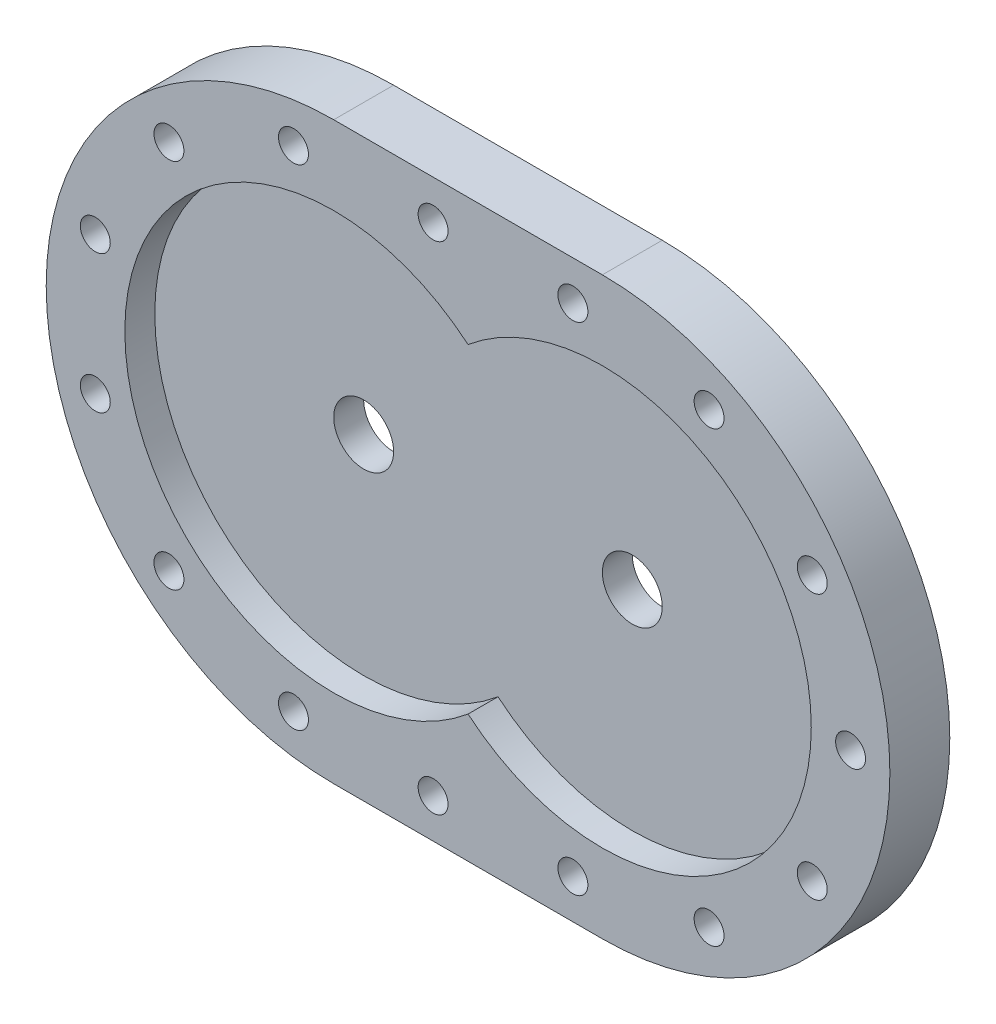
ISO-10303-21;
HEADER;
FILE_DESCRIPTION(('STEP AP214'),'2;1');
FILE_NAME('part.step','',(''),(''),'','','');
FILE_SCHEMA(('AUTOMOTIVE_DESIGN { 1 0 10303 214 1 1 1 1 }'));
ENDSEC;
DATA;
#1=APPLICATION_CONTEXT('core data for automotive mechanical design processes');
#2=APPLICATION_PROTOCOL_DEFINITION('international standard','automotive_design',2000,#1);
#3=PRODUCT_CONTEXT('',#1,'mechanical');
#4=PRODUCT('Part','Part','',(#3));
#5=PRODUCT_RELATED_PRODUCT_CATEGORY('part','',(#4));
#6=PRODUCT_DEFINITION_FORMATION('','',#4);
#7=PRODUCT_DEFINITION_CONTEXT('part definition',#1,'design');
#8=PRODUCT_DEFINITION('design','',#6,#7);
#9=PRODUCT_DEFINITION_SHAPE('','',#8);
#10=(LENGTH_UNIT() NAMED_UNIT(*) SI_UNIT(.MILLI.,.METRE.));
#11=(NAMED_UNIT(*) PLANE_ANGLE_UNIT() SI_UNIT($,.RADIAN.));
#12=(NAMED_UNIT(*) SI_UNIT($,.STERADIAN.) SOLID_ANGLE_UNIT());
#13=UNCERTAINTY_MEASURE_WITH_UNIT(LENGTH_MEASURE(1.E-05),#10,'distance_accuracy_value','');
#14=(GEOMETRIC_REPRESENTATION_CONTEXT(3) GLOBAL_UNCERTAINTY_ASSIGNED_CONTEXT((#13)) GLOBAL_UNIT_ASSIGNED_CONTEXT((#10,
#11,#12)) REPRESENTATION_CONTEXT('',''));
#15=CARTESIAN_POINT('',(0.,0.,0.));
#16=DIRECTION('',(0.,0.,1.));
#17=DIRECTION('',(1.,0.,0.));
#18=AXIS2_PLACEMENT_3D('',#15,#16,#17);
#19=CARTESIAN_POINT('',(0.,-96.,20.));
#20=DIRECTION('',(0.,1.,0.));
#21=DIRECTION('',(-1.,0.,0.));
#22=AXIS2_PLACEMENT_3D('',#19,#20,#21);
#23=PLANE('',#22);
#24=DIRECTION('',(1.,0.,0.));
#25=VECTOR('',#24,1.);
#26=CARTESIAN_POINT('',(0.,-96.,0.));
#27=LINE('',#26,#25);
#28=CARTESIAN_POINT('',(-44.845,-96.,0.));
#29=VERTEX_POINT('',#28);
#30=CARTESIAN_POINT('',(44.845,-96.,0.));
#31=VERTEX_POINT('',#30);
#32=EDGE_CURVE('E157',#29,#31,#27,.T.);
#33=ORIENTED_EDGE('',*,*,#32,.T.);
#34=DIRECTION('',(0.,0.,-1.));
#35=VECTOR('',#34,1.);
#36=CARTESIAN_POINT('',(44.845,-96.,20.));
#37=LINE('',#36,#35);
#38=CARTESIAN_POINT('',(44.845,-96.,20.));
#39=VERTEX_POINT('',#38);
#40=EDGE_CURVE('E13',#39,#31,#37,.T.);
#41=ORIENTED_EDGE('',*,*,#40,.F.);
#42=DIRECTION('',(1.,0.,0.));
#43=VECTOR('',#42,1.);
#44=CARTESIAN_POINT('',(0.,-96.,20.));
#45=LINE('',#44,#43);
#46=CARTESIAN_POINT('',(-44.845,-96.,20.));
#47=VERTEX_POINT('',#46);
#48=EDGE_CURVE('E139',#47,#39,#45,.T.);
#49=ORIENTED_EDGE('',*,*,#48,.F.);
#50=DIRECTION('',(0.,0.,-1.));
#51=VECTOR('',#50,1.);
#52=CARTESIAN_POINT('',(-44.845,-96.,20.));
#53=LINE('',#52,#51);
#54=EDGE_CURVE('E166',#47,#29,#53,.T.);
#55=ORIENTED_EDGE('',*,*,#54,.T.);
#56=EDGE_LOOP('',(#33,#41,#49,#55));
#57=FACE_BOUND('',#56,.T.);
#58=ADVANCED_FACE('F71',(#57),#23,.F.);
#59=CARTESIAN_POINT('',(44.845,0.,20.));
#60=DIRECTION('',(0.,0.,-1.));
#61=DIRECTION('',(-1.,0.,0.));
#62=AXIS2_PLACEMENT_3D('',#59,#60,#61);
#63=CYLINDRICAL_SURFACE('',#62,96.);
#64=CARTESIAN_POINT('',(44.845,0.,0.));
#65=DIRECTION('',(0.,0.,1.));
#66=DIRECTION('',(1.,0.,0.));
#67=AXIS2_PLACEMENT_3D('',#64,#65,#66);
#68=CIRCLE('',#67,96.);
#69=CARTESIAN_POINT('',(44.845,96.,0.));
#70=VERTEX_POINT('',#69);
#71=EDGE_CURVE('E145',#31,#70,#68,.T.);
#72=ORIENTED_EDGE('',*,*,#71,.T.);
#73=DIRECTION('',(0.,0.,-1.));
#74=VECTOR('',#73,1.);
#75=CARTESIAN_POINT('',(44.845,96.,20.));
#76=LINE('',#75,#74);
#77=CARTESIAN_POINT('',(44.845,96.,20.));
#78=VERTEX_POINT('',#77);
#79=EDGE_CURVE('E80',#78,#70,#76,.T.);
#80=ORIENTED_EDGE('',*,*,#79,.F.);
#81=CARTESIAN_POINT('',(44.845,0.,20.));
#82=DIRECTION('',(0.,0.,1.));
#83=DIRECTION('',(1.,0.,0.));
#84=AXIS2_PLACEMENT_3D('',#81,#82,#83);
#85=CIRCLE('',#84,96.);
#86=EDGE_CURVE('E133',#39,#78,#85,.T.);
#87=ORIENTED_EDGE('',*,*,#86,.F.);
#88=ORIENTED_EDGE('',*,*,#40,.T.);
#89=EDGE_LOOP('',(#72,#80,#87,#88));
#90=FACE_BOUND('',#89,.T.);
#91=ADVANCED_FACE('F144',(#90),#63,.T.);
#92=CARTESIAN_POINT('',(0.,96.,20.));
#93=DIRECTION('',(0.,1.,0.));
#94=DIRECTION('',(-1.,0.,0.));
#95=AXIS2_PLACEMENT_3D('',#92,#93,#94);
#96=PLANE('',#95);
#97=DIRECTION('',(1.,0.,0.));
#98=VECTOR('',#97,1.);
#99=CARTESIAN_POINT('',(0.,96.,0.));
#100=LINE('',#99,#98);
#101=CARTESIAN_POINT('',(-44.845,96.,0.));
#102=VERTEX_POINT('',#101);
#103=EDGE_CURVE('E162',#102,#70,#100,.T.);
#104=ORIENTED_EDGE('',*,*,#103,.F.);
#105=DIRECTION('',(0.,0.,-1.));
#106=VECTOR('',#105,1.);
#107=CARTESIAN_POINT('',(-44.845,96.,20.));
#108=LINE('',#107,#106);
#109=CARTESIAN_POINT('',(-44.845,96.,20.));
#110=VERTEX_POINT('',#109);
#111=EDGE_CURVE('E149',#110,#102,#108,.T.);
#112=ORIENTED_EDGE('',*,*,#111,.F.);
#113=DIRECTION('',(1.,0.,0.));
#114=VECTOR('',#113,1.);
#115=CARTESIAN_POINT('',(0.,96.,20.));
#116=LINE('',#115,#114);
#117=EDGE_CURVE('E137',#110,#78,#116,.T.);
#118=ORIENTED_EDGE('',*,*,#117,.T.);
#119=ORIENTED_EDGE('',*,*,#79,.T.);
#120=EDGE_LOOP('',(#104,#112,#118,#119));
#121=FACE_BOUND('',#120,.T.);
#122=ADVANCED_FACE('F151',(#121),#96,.T.);
#123=CARTESIAN_POINT('',(-44.845,0.,20.));
#124=DIRECTION('',(0.,0.,-1.));
#125=DIRECTION('',(-1.,0.,0.));
#126=AXIS2_PLACEMENT_3D('',#123,#124,#125);
#127=CYLINDRICAL_SURFACE('',#126,69.75);
#128=CARTESIAN_POINT('',(-44.845,0.,10.));
#129=DIRECTION('',(0.,0.,1.));
#130=DIRECTION('',(1.,0.,0.));
#131=AXIS2_PLACEMENT_3D('',#128,#129,#130);
#132=CIRCLE('',#131,69.75);
#133=CARTESIAN_POINT('',(0.,53.4227336908174,10.));
#134=VERTEX_POINT('',#133);
#135=CARTESIAN_POINT('',(0.,-53.4227336908174,10.));
#136=VERTEX_POINT('',#135);
#137=EDGE_CURVE('E160',#134,#136,#132,.T.);
#138=ORIENTED_EDGE('',*,*,#137,.F.);
#139=DIRECTION('',(0.,0.,-1.));
#140=VECTOR('',#139,1.);
#141=CARTESIAN_POINT('',(0.,53.4227336908174,20.));
#142=LINE('',#141,#140);
#143=CARTESIAN_POINT('',(0.,53.4227336908174,20.));
#144=VERTEX_POINT('',#143);
#145=EDGE_CURVE('E75',#144,#134,#142,.T.);
#146=ORIENTED_EDGE('',*,*,#145,.F.);
#147=CARTESIAN_POINT('',(-44.845,0.,20.));
#148=DIRECTION('',(0.,0.,1.));
#149=DIRECTION('',(1.,0.,0.));
#150=AXIS2_PLACEMENT_3D('',#147,#148,#149);
#151=CIRCLE('',#150,69.75);
#152=CARTESIAN_POINT('',(0.,-53.4227336908174,20.));
#153=VERTEX_POINT('',#152);
#154=EDGE_CURVE('E165',#144,#153,#151,.T.);
#155=ORIENTED_EDGE('',*,*,#154,.T.);
#156=DIRECTION('',(0.,0.,-1.));
#157=VECTOR('',#156,1.);
#158=CARTESIAN_POINT('',(0.,-53.4227336908174,20.));
#159=LINE('',#158,#157);
#160=EDGE_CURVE('E153',#153,#136,#159,.T.);
#161=ORIENTED_EDGE('',*,*,#160,.T.);
#162=EDGE_LOOP('',(#138,#146,#155,#161));
#163=FACE_BOUND('',#162,.T.);
#164=ADVANCED_FACE('F73',(#163),#127,.F.);
#165=CARTESIAN_POINT('',(44.845,0.,20.));
#166=DIRECTION('',(0.,0.,-1.));
#167=DIRECTION('',(-1.,0.,0.));
#168=AXIS2_PLACEMENT_3D('',#165,#166,#167);
#169=CYLINDRICAL_SURFACE('',#168,69.75);
#170=CARTESIAN_POINT('',(44.845,0.,10.));
#171=DIRECTION('',(0.,0.,1.));
#172=DIRECTION('',(1.,0.,0.));
#173=AXIS2_PLACEMENT_3D('',#170,#171,#172);
#174=CIRCLE('',#173,69.75);
#175=EDGE_CURVE('E88',#136,#134,#174,.T.);
#176=ORIENTED_EDGE('',*,*,#175,.F.);
#177=ORIENTED_EDGE('',*,*,#160,.F.);
#178=CARTESIAN_POINT('',(44.845,0.,20.));
#179=DIRECTION('',(0.,0.,1.));
#180=DIRECTION('',(1.,0.,0.));
#181=AXIS2_PLACEMENT_3D('',#178,#179,#180);
#182=CIRCLE('',#181,69.75);
#183=EDGE_CURVE('E172',#153,#144,#182,.T.);
#184=ORIENTED_EDGE('',*,*,#183,.T.);
#185=ORIENTED_EDGE('',*,*,#145,.T.);
#186=EDGE_LOOP('',(#176,#177,#184,#185));
#187=FACE_BOUND('',#186,.T.);
#188=ADVANCED_FACE('F170',(#187),#169,.F.);
#189=CARTESIAN_POINT('',(-44.845,0.,20.));
#190=DIRECTION('',(0.,0.,-1.));
#191=DIRECTION('',(-1.,0.,0.));
#192=AXIS2_PLACEMENT_3D('',#189,#190,#191);
#193=CYLINDRICAL_SURFACE('',#192,96.);
#194=CARTESIAN_POINT('',(-44.845,0.,0.));
#195=DIRECTION('',(0.,0.,1.));
#196=DIRECTION('',(1.,0.,0.));
#197=AXIS2_PLACEMENT_3D('',#194,#195,#196);
#198=CIRCLE('',#197,96.);
#199=EDGE_CURVE('E118',#102,#29,#198,.T.);
#200=ORIENTED_EDGE('',*,*,#199,.T.);
#201=ORIENTED_EDGE('',*,*,#54,.F.);
#202=CARTESIAN_POINT('',(-44.845,0.,20.));
#203=DIRECTION('',(0.,0.,1.));
#204=DIRECTION('',(1.,0.,0.));
#205=AXIS2_PLACEMENT_3D('',#202,#203,#204);
#206=CIRCLE('',#205,96.);
#207=EDGE_CURVE('E97',#110,#47,#206,.T.);
#208=ORIENTED_EDGE('',*,*,#207,.F.);
#209=ORIENTED_EDGE('',*,*,#111,.T.);
#210=EDGE_LOOP('',(#200,#201,#208,#209));
#211=FACE_BOUND('',#210,.T.);
#212=ADVANCED_FACE('F194',(#211),#193,.T.);
#213=CARTESIAN_POINT('',(0.,0.,20.));
#214=DIRECTION('',(0.,0.,1.));
#215=DIRECTION('',(1.,0.,0.));
#216=AXIS2_PLACEMENT_3D('',#213,#214,#215);
#217=PLANE('',#216);
#218=CARTESIAN_POINT('',(114.921070285134,-44.2448866920577,19.9999999999983));
#219=DIRECTION('',(0.,0.,1.));
#220=DIRECTION('',(1.,0.,0.));
#221=AXIS2_PLACEMENT_3D('',#218,#219,#220);
#222=CIRCLE('',#221,4.99999999999999);
#223=CARTESIAN_POINT('',(119.921070285134,-44.2448866920577,19.9999999999983));
#224=VERTEX_POINT('',#223);
#225=EDGE_CURVE('E453',#224,#224,#222,.T.);
#226=ORIENTED_EDGE('',*,*,#225,.F.);
#227=EDGE_LOOP('',(#226));
#228=FACE_BOUND('',#227,.T.);
#229=CARTESIAN_POINT('',(80.4775264339541,-74.8237173958469,19.9999999999983));
#230=DIRECTION('',(0.,0.,1.));
#231=DIRECTION('',(1.,0.,0.));
#232=AXIS2_PLACEMENT_3D('',#229,#230,#231);
#233=CIRCLE('',#232,4.99999999999999);
#234=CARTESIAN_POINT('',(85.4775264339541,-74.8237173958469,19.9999999999983));
#235=VERTEX_POINT('',#234);
#236=EDGE_CURVE('E455',#235,#235,#233,.T.);
#237=ORIENTED_EDGE('',*,*,#236,.F.);
#238=EDGE_LOOP('',(#237));
#239=FACE_BOUND('',#238,.T.);
#240=CARTESIAN_POINT('',(35.0049491166254,-82.875,19.9999999999983));
#241=DIRECTION('',(0.,0.,1.));
#242=DIRECTION('',(1.,0.,0.));
#243=AXIS2_PLACEMENT_3D('',#240,#241,#242);
#244=CIRCLE('',#243,4.99999999999999);
#245=CARTESIAN_POINT('',(40.0049491166254,-82.875,19.9999999999983));
#246=VERTEX_POINT('',#245);
#247=EDGE_CURVE('E463',#246,#246,#244,.T.);
#248=ORIENTED_EDGE('',*,*,#247,.F.);
#249=EDGE_LOOP('',(#248));
#250=FACE_BOUND('',#249,.T.);
#251=CARTESIAN_POINT('',(-11.6683163722085,-82.875,19.9999999999983));
#252=DIRECTION('',(0.,0.,1.));
#253=DIRECTION('',(1.,0.,0.));
#254=AXIS2_PLACEMENT_3D('',#251,#252,#253);
#255=CIRCLE('',#254,4.99999999999999);
#256=CARTESIAN_POINT('',(-6.66831637220851,-82.875,19.9999999999983));
#257=VERTEX_POINT('',#256);
#258=EDGE_CURVE('E469',#257,#257,#255,.T.);
#259=ORIENTED_EDGE('',*,*,#258,.F.);
#260=EDGE_LOOP('',(#259));
#261=FACE_BOUND('',#260,.T.);
#262=CARTESIAN_POINT('',(-58.2820023248743,-81.7784359933676,19.9999999999983));
#263=DIRECTION('',(0.,0.,1.));
#264=DIRECTION('',(1.,0.,0.));
#265=AXIS2_PLACEMENT_3D('',#262,#263,#264);
#266=CIRCLE('',#265,4.99999999999999);
#267=CARTESIAN_POINT('',(-53.2820023248743,-81.7784359933676,19.9999999999983));
#268=VERTEX_POINT('',#267);
#269=EDGE_CURVE('E475',#268,#268,#266,.T.);
#270=ORIENTED_EDGE('',*,*,#269,.F.);
#271=EDGE_LOOP('',(#270));
#272=FACE_BOUND('',#271,.T.);
#273=CARTESIAN_POINT('',(-99.8662965758027,-61.9751768704016,19.9999999999983));
#274=DIRECTION('',(0.,0.,1.));
#275=DIRECTION('',(1.,0.,0.));
#276=AXIS2_PLACEMENT_3D('',#273,#274,#275);
#277=CIRCLE('',#276,4.99999999999999);
#278=CARTESIAN_POINT('',(-94.8662965758027,-61.9751768704016,19.9999999999983));
#279=VERTEX_POINT('',#278);
#280=EDGE_CURVE('E481',#279,#279,#277,.T.);
#281=ORIENTED_EDGE('',*,*,#280,.F.);
#282=EDGE_LOOP('',(#281));
#283=FACE_BOUND('',#282,.T.);
#284=CARTESIAN_POINT('',(-124.455991546018,-23.0294517967705,19.9999999999983));
#285=DIRECTION('',(0.,0.,1.));
#286=DIRECTION('',(1.,0.,0.));
#287=AXIS2_PLACEMENT_3D('',#284,#285,#286);
#288=CIRCLE('',#287,4.99999999999999);
#289=CARTESIAN_POINT('',(-119.455991546018,-23.0294517967705,19.9999999999983));
#290=VERTEX_POINT('',#289);
#291=EDGE_CURVE('E487',#290,#290,#288,.T.);
#292=ORIENTED_EDGE('',*,*,#291,.F.);
#293=EDGE_LOOP('',(#292));
#294=FACE_BOUND('',#293,.T.);
#295=CARTESIAN_POINT('',(-124.455991546018,23.0294517967706,19.9999999999983));
#296=DIRECTION('',(0.,0.,1.));
#297=DIRECTION('',(1.,0.,0.));
#298=AXIS2_PLACEMENT_3D('',#295,#296,#297);
#299=CIRCLE('',#298,4.99999999999999);
#300=CARTESIAN_POINT('',(-119.455991546018,23.0294517967706,19.9999999999983));
#301=VERTEX_POINT('',#300);
#302=EDGE_CURVE('E493',#301,#301,#299,.T.);
#303=ORIENTED_EDGE('',*,*,#302,.F.);
#304=EDGE_LOOP('',(#303));
#305=FACE_BOUND('',#304,.T.);
#306=CARTESIAN_POINT('',(-99.8662965758025,61.9751768704018,19.9999999999983));
#307=DIRECTION('',(0.,0.,1.));
#308=DIRECTION('',(1.,0.,0.));
#309=AXIS2_PLACEMENT_3D('',#306,#307,#308);
#310=CIRCLE('',#309,4.99999999999999);
#311=CARTESIAN_POINT('',(-94.8662965758025,61.9751768704018,19.9999999999983));
#312=VERTEX_POINT('',#311);
#313=EDGE_CURVE('E499',#312,#312,#310,.T.);
#314=ORIENTED_EDGE('',*,*,#313,.F.);
#315=EDGE_LOOP('',(#314));
#316=FACE_BOUND('',#315,.T.);
#317=CARTESIAN_POINT('',(-58.2820023248742,81.7784359933676,19.9999999999983));
#318=DIRECTION('',(0.,0.,1.));
#319=DIRECTION('',(1.,0.,0.));
#320=AXIS2_PLACEMENT_3D('',#317,#318,#319);
#321=CIRCLE('',#320,4.99999999999999);
#322=CARTESIAN_POINT('',(-53.2820023248742,81.7784359933676,19.9999999999983));
#323=VERTEX_POINT('',#322);
#324=EDGE_CURVE('E505',#323,#323,#321,.T.);
#325=ORIENTED_EDGE('',*,*,#324,.F.);
#326=EDGE_LOOP('',(#325));
#327=FACE_BOUND('',#326,.T.);
#328=CARTESIAN_POINT('',(-11.6683163722084,82.875,19.9999999999983));
#329=DIRECTION('',(0.,0.,1.));
#330=DIRECTION('',(1.,0.,0.));
#331=AXIS2_PLACEMENT_3D('',#328,#329,#330);
#332=CIRCLE('',#331,4.99999999999999);
#333=CARTESIAN_POINT('',(-6.66831637220846,82.875,19.9999999999983));
#334=VERTEX_POINT('',#333);
#335=EDGE_CURVE('E511',#334,#334,#332,.T.);
#336=ORIENTED_EDGE('',*,*,#335,.F.);
#337=EDGE_LOOP('',(#336));
#338=FACE_BOUND('',#337,.T.);
#339=CARTESIAN_POINT('',(35.0049491166254,82.875,19.9999999999983));
#340=DIRECTION('',(0.,0.,1.));
#341=DIRECTION('',(1.,0.,0.));
#342=AXIS2_PLACEMENT_3D('',#339,#340,#341);
#343=CIRCLE('',#342,4.99999999999999);
#344=CARTESIAN_POINT('',(40.0049491166254,82.875,19.9999999999983));
#345=VERTEX_POINT('',#344);
#346=EDGE_CURVE('E517',#345,#345,#343,.T.);
#347=ORIENTED_EDGE('',*,*,#346,.F.);
#348=EDGE_LOOP('',(#347));
#349=FACE_BOUND('',#348,.T.);
#350=CARTESIAN_POINT('',(80.4775264339541,74.8237173958469,19.9999999999983));
#351=DIRECTION('',(0.,0.,1.));
#352=DIRECTION('',(1.,0.,0.));
#353=AXIS2_PLACEMENT_3D('',#350,#351,#352);
#354=CIRCLE('',#353,4.99999999999999);
#355=CARTESIAN_POINT('',(85.4775264339541,74.8237173958469,19.9999999999983));
#356=VERTEX_POINT('',#355);
#357=EDGE_CURVE('E523',#356,#356,#354,.T.);
#358=ORIENTED_EDGE('',*,*,#357,.F.);
#359=EDGE_LOOP('',(#358));
#360=FACE_BOUND('',#359,.T.);
#361=CARTESIAN_POINT('',(114.921070285133,44.2448866920577,19.9999999999983));
#362=DIRECTION('',(0.,0.,1.));
#363=DIRECTION('',(1.,0.,0.));
#364=AXIS2_PLACEMENT_3D('',#361,#362,#363);
#365=CIRCLE('',#364,4.99999999999999);
#366=CARTESIAN_POINT('',(119.921070285133,44.2448866920577,19.9999999999983));
#367=VERTEX_POINT('',#366);
#368=EDGE_CURVE('E529',#367,#367,#365,.T.);
#369=ORIENTED_EDGE('',*,*,#368,.F.);
#370=EDGE_LOOP('',(#369));
#371=FACE_BOUND('',#370,.T.);
#372=CARTESIAN_POINT('',(127.72,0.,20.));
#373=DIRECTION('',(0.,0.,1.));
#374=DIRECTION('',(1.,0.,0.));
#375=AXIS2_PLACEMENT_3D('',#372,#373,#374);
#376=CIRCLE('',#375,4.99999999999998);
#377=CARTESIAN_POINT('',(132.72,0.,20.));
#378=VERTEX_POINT('',#377);
#379=EDGE_CURVE('E535',#378,#378,#376,.T.);
#380=ORIENTED_EDGE('',*,*,#379,.F.);
#381=EDGE_LOOP('',(#380));
#382=FACE_BOUND('',#381,.T.);
#383=ORIENTED_EDGE('',*,*,#154,.F.);
#384=ORIENTED_EDGE('',*,*,#183,.F.);
#385=EDGE_LOOP('',(#383,#384));
#386=FACE_BOUND('',#385,.T.);
#387=ORIENTED_EDGE('',*,*,#48,.T.);
#388=ORIENTED_EDGE('',*,*,#86,.T.);
#389=ORIENTED_EDGE('',*,*,#117,.F.);
#390=ORIENTED_EDGE('',*,*,#207,.T.);
#391=EDGE_LOOP('',(#387,#388,#389,#390));
#392=FACE_BOUND('',#391,.T.);
#393=ADVANCED_FACE('F135',(#228,#239,#250,#261,#272,#283,#294,#305,#316,#327,#338,#349,#360,
#371,#382,#386,#392),#217,.T.);
#394=CARTESIAN_POINT('',(0.,0.,0.));
#395=DIRECTION('',(0.,0.,1.));
#396=DIRECTION('',(1.,0.,0.));
#397=AXIS2_PLACEMENT_3D('',#394,#395,#396);
#398=PLANE('',#397);
#399=CARTESIAN_POINT('',(114.921070285134,-44.2448866920577,0.));
#400=DIRECTION('',(0.,0.,1.));
#401=DIRECTION('',(1.,0.,0.));
#402=AXIS2_PLACEMENT_3D('',#399,#400,#401);
#403=CIRCLE('',#402,4.99999999999999);
#404=CARTESIAN_POINT('',(119.921070285134,-44.2448866920577,0.));
#405=VERTEX_POINT('',#404);
#406=EDGE_CURVE('E451',#405,#405,#403,.T.);
#407=ORIENTED_EDGE('',*,*,#406,.T.);
#408=EDGE_LOOP('',(#407));
#409=FACE_BOUND('',#408,.T.);
#410=CARTESIAN_POINT('',(80.4775264339541,-74.8237173958469,0.));
#411=DIRECTION('',(0.,0.,1.));
#412=DIRECTION('',(1.,0.,0.));
#413=AXIS2_PLACEMENT_3D('',#410,#411,#412);
#414=CIRCLE('',#413,4.99999999999999);
#415=CARTESIAN_POINT('',(85.4775264339541,-74.8237173958469,0.));
#416=VERTEX_POINT('',#415);
#417=EDGE_CURVE('E460',#416,#416,#414,.T.);
#418=ORIENTED_EDGE('',*,*,#417,.T.);
#419=EDGE_LOOP('',(#418));
#420=FACE_BOUND('',#419,.T.);
#421=CARTESIAN_POINT('',(35.0049491166254,-82.875,0.));
#422=DIRECTION('',(0.,0.,1.));
#423=DIRECTION('',(1.,0.,0.));
#424=AXIS2_PLACEMENT_3D('',#421,#422,#423);
#425=CIRCLE('',#424,4.99999999999999);
#426=CARTESIAN_POINT('',(40.0049491166254,-82.875,0.));
#427=VERTEX_POINT('',#426);
#428=EDGE_CURVE('E466',#427,#427,#425,.T.);
#429=ORIENTED_EDGE('',*,*,#428,.T.);
#430=EDGE_LOOP('',(#429));
#431=FACE_BOUND('',#430,.T.);
#432=CARTESIAN_POINT('',(-11.6683163722085,-82.875,0.));
#433=DIRECTION('',(0.,0.,1.));
#434=DIRECTION('',(1.,0.,0.));
#435=AXIS2_PLACEMENT_3D('',#432,#433,#434);
#436=CIRCLE('',#435,4.99999999999999);
#437=CARTESIAN_POINT('',(-6.66831637220851,-82.875,0.));
#438=VERTEX_POINT('',#437);
#439=EDGE_CURVE('E472',#438,#438,#436,.T.);
#440=ORIENTED_EDGE('',*,*,#439,.T.);
#441=EDGE_LOOP('',(#440));
#442=FACE_BOUND('',#441,.T.);
#443=CARTESIAN_POINT('',(-58.2820023248743,-81.7784359933676,0.));
#444=DIRECTION('',(0.,0.,1.));
#445=DIRECTION('',(1.,0.,0.));
#446=AXIS2_PLACEMENT_3D('',#443,#444,#445);
#447=CIRCLE('',#446,4.99999999999999);
#448=CARTESIAN_POINT('',(-53.2820023248743,-81.7784359933676,0.));
#449=VERTEX_POINT('',#448);
#450=EDGE_CURVE('E478',#449,#449,#447,.T.);
#451=ORIENTED_EDGE('',*,*,#450,.T.);
#452=EDGE_LOOP('',(#451));
#453=FACE_BOUND('',#452,.T.);
#454=CARTESIAN_POINT('',(-99.8662965758027,-61.9751768704016,0.));
#455=DIRECTION('',(0.,0.,1.));
#456=DIRECTION('',(1.,0.,0.));
#457=AXIS2_PLACEMENT_3D('',#454,#455,#456);
#458=CIRCLE('',#457,4.99999999999999);
#459=CARTESIAN_POINT('',(-94.8662965758027,-61.9751768704016,0.));
#460=VERTEX_POINT('',#459);
#461=EDGE_CURVE('E484',#460,#460,#458,.T.);
#462=ORIENTED_EDGE('',*,*,#461,.T.);
#463=EDGE_LOOP('',(#462));
#464=FACE_BOUND('',#463,.T.);
#465=CARTESIAN_POINT('',(-124.455991546018,-23.0294517967705,0.));
#466=DIRECTION('',(0.,0.,1.));
#467=DIRECTION('',(1.,0.,0.));
#468=AXIS2_PLACEMENT_3D('',#465,#466,#467);
#469=CIRCLE('',#468,4.99999999999999);
#470=CARTESIAN_POINT('',(-119.455991546018,-23.0294517967705,0.));
#471=VERTEX_POINT('',#470);
#472=EDGE_CURVE('E490',#471,#471,#469,.T.);
#473=ORIENTED_EDGE('',*,*,#472,.T.);
#474=EDGE_LOOP('',(#473));
#475=FACE_BOUND('',#474,.T.);
#476=CARTESIAN_POINT('',(-124.455991546018,23.0294517967706,0.));
#477=DIRECTION('',(0.,0.,1.));
#478=DIRECTION('',(1.,0.,0.));
#479=AXIS2_PLACEMENT_3D('',#476,#477,#478);
#480=CIRCLE('',#479,4.99999999999999);
#481=CARTESIAN_POINT('',(-119.455991546018,23.0294517967706,0.));
#482=VERTEX_POINT('',#481);
#483=EDGE_CURVE('E496',#482,#482,#480,.T.);
#484=ORIENTED_EDGE('',*,*,#483,.T.);
#485=EDGE_LOOP('',(#484));
#486=FACE_BOUND('',#485,.T.);
#487=CARTESIAN_POINT('',(-99.8662965758025,61.9751768704018,0.));
#488=DIRECTION('',(0.,0.,1.));
#489=DIRECTION('',(1.,0.,0.));
#490=AXIS2_PLACEMENT_3D('',#487,#488,#489);
#491=CIRCLE('',#490,4.99999999999999);
#492=CARTESIAN_POINT('',(-94.8662965758025,61.9751768704018,0.));
#493=VERTEX_POINT('',#492);
#494=EDGE_CURVE('E502',#493,#493,#491,.T.);
#495=ORIENTED_EDGE('',*,*,#494,.T.);
#496=EDGE_LOOP('',(#495));
#497=FACE_BOUND('',#496,.T.);
#498=CARTESIAN_POINT('',(-58.2820023248742,81.7784359933676,0.));
#499=DIRECTION('',(0.,0.,1.));
#500=DIRECTION('',(1.,0.,0.));
#501=AXIS2_PLACEMENT_3D('',#498,#499,#500);
#502=CIRCLE('',#501,4.99999999999999);
#503=CARTESIAN_POINT('',(-53.2820023248742,81.7784359933676,0.));
#504=VERTEX_POINT('',#503);
#505=EDGE_CURVE('E508',#504,#504,#502,.T.);
#506=ORIENTED_EDGE('',*,*,#505,.T.);
#507=EDGE_LOOP('',(#506));
#508=FACE_BOUND('',#507,.T.);
#509=CARTESIAN_POINT('',(-11.6683163722084,82.875,0.));
#510=DIRECTION('',(0.,0.,1.));
#511=DIRECTION('',(1.,0.,0.));
#512=AXIS2_PLACEMENT_3D('',#509,#510,#511);
#513=CIRCLE('',#512,4.99999999999999);
#514=CARTESIAN_POINT('',(-6.66831637220845,82.875,0.));
#515=VERTEX_POINT('',#514);
#516=EDGE_CURVE('E514',#515,#515,#513,.T.);
#517=ORIENTED_EDGE('',*,*,#516,.T.);
#518=EDGE_LOOP('',(#517));
#519=FACE_BOUND('',#518,.T.);
#520=CARTESIAN_POINT('',(35.0049491166254,82.875,0.));
#521=DIRECTION('',(0.,0.,1.));
#522=DIRECTION('',(1.,0.,0.));
#523=AXIS2_PLACEMENT_3D('',#520,#521,#522);
#524=CIRCLE('',#523,4.99999999999999);
#525=CARTESIAN_POINT('',(40.0049491166254,82.875,0.));
#526=VERTEX_POINT('',#525);
#527=EDGE_CURVE('E520',#526,#526,#524,.T.);
#528=ORIENTED_EDGE('',*,*,#527,.T.);
#529=EDGE_LOOP('',(#528));
#530=FACE_BOUND('',#529,.T.);
#531=CARTESIAN_POINT('',(80.4775264339541,74.8237173958469,0.));
#532=DIRECTION('',(0.,0.,1.));
#533=DIRECTION('',(1.,0.,0.));
#534=AXIS2_PLACEMENT_3D('',#531,#532,#533);
#535=CIRCLE('',#534,4.99999999999999);
#536=CARTESIAN_POINT('',(85.4775264339541,74.8237173958469,0.));
#537=VERTEX_POINT('',#536);
#538=EDGE_CURVE('E526',#537,#537,#535,.T.);
#539=ORIENTED_EDGE('',*,*,#538,.T.);
#540=EDGE_LOOP('',(#539));
#541=FACE_BOUND('',#540,.T.);
#542=CARTESIAN_POINT('',(114.921070285133,44.2448866920577,0.));
#543=DIRECTION('',(0.,0.,1.));
#544=DIRECTION('',(1.,0.,0.));
#545=AXIS2_PLACEMENT_3D('',#542,#543,#544);
#546=CIRCLE('',#545,4.99999999999999);
#547=CARTESIAN_POINT('',(119.921070285133,44.2448866920577,0.));
#548=VERTEX_POINT('',#547);
#549=EDGE_CURVE('E532',#548,#548,#546,.T.);
#550=ORIENTED_EDGE('',*,*,#549,.T.);
#551=EDGE_LOOP('',(#550));
#552=FACE_BOUND('',#551,.T.);
#553=CARTESIAN_POINT('',(127.72,0.,0.));
#554=DIRECTION('',(0.,0.,1.));
#555=DIRECTION('',(1.,0.,0.));
#556=AXIS2_PLACEMENT_3D('',#553,#554,#555);
#557=CIRCLE('',#556,4.99999999999999);
#558=CARTESIAN_POINT('',(132.72,0.,0.));
#559=VERTEX_POINT('',#558);
#560=EDGE_CURVE('E187',#559,#559,#557,.T.);
#561=ORIENTED_EDGE('',*,*,#560,.T.);
#562=EDGE_LOOP('',(#561));
#563=FACE_BOUND('',#562,.T.);
#564=ORIENTED_EDGE('',*,*,#32,.F.);
#565=ORIENTED_EDGE('',*,*,#199,.F.);
#566=ORIENTED_EDGE('',*,*,#103,.T.);
#567=ORIENTED_EDGE('',*,*,#71,.F.);
#568=EDGE_LOOP('',(#564,#565,#566,#567));
#569=FACE_BOUND('',#568,.T.);
#570=CARTESIAN_POINT('',(-44.845,0.,0.));
#571=DIRECTION('',(0.,0.,1.));
#572=DIRECTION('',(1.,0.,0.));
#573=AXIS2_PLACEMENT_3D('',#570,#571,#572);
#574=CIRCLE('',#573,10.);
#575=CARTESIAN_POINT('',(-34.845,0.,0.));
#576=VERTEX_POINT('',#575);
#577=EDGE_CURVE('E183',#576,#576,#574,.T.);
#578=ORIENTED_EDGE('',*,*,#577,.T.);
#579=EDGE_LOOP('',(#578));
#580=FACE_BOUND('',#579,.T.);
#581=CARTESIAN_POINT('',(44.845,0.,0.));
#582=DIRECTION('',(0.,0.,1.));
#583=DIRECTION('',(1.,0.,0.));
#584=AXIS2_PLACEMENT_3D('',#581,#582,#583);
#585=CIRCLE('',#584,10.);
#586=CARTESIAN_POINT('',(54.845,0.,0.));
#587=VERTEX_POINT('',#586);
#588=EDGE_CURVE('E186',#587,#587,#585,.T.);
#589=ORIENTED_EDGE('',*,*,#588,.T.);
#590=EDGE_LOOP('',(#589));
#591=FACE_BOUND('',#590,.T.);
#592=ADVANCED_FACE('F193',(#409,#420,#431,#442,#453,#464,#475,#486,#497,#508,#519,#530,#541,
#552,#563,#569,#580,#591),#398,.F.);
#593=CARTESIAN_POINT('',(44.845,0.,10.));
#594=DIRECTION('',(0.,0.,-1.));
#595=DIRECTION('',(-1.,0.,0.));
#596=AXIS2_PLACEMENT_3D('',#593,#594,#595);
#597=CYLINDRICAL_SURFACE('',#596,10.);
#598=CARTESIAN_POINT('',(44.845,0.,10.));
#599=DIRECTION('',(0.,0.,1.));
#600=DIRECTION('',(1.,0.,0.));
#601=AXIS2_PLACEMENT_3D('',#598,#599,#600);
#602=CIRCLE('',#601,10.);
#603=CARTESIAN_POINT('',(54.845,0.,10.));
#604=VERTEX_POINT('',#603);
#605=EDGE_CURVE('E176',#604,#604,#602,.T.);
#606=ORIENTED_EDGE('',*,*,#605,.T.);
#607=EDGE_LOOP('',(#606));
#608=FACE_BOUND('',#607,.T.);
#609=ORIENTED_EDGE('',*,*,#588,.F.);
#610=EDGE_LOOP('',(#609));
#611=FACE_BOUND('',#610,.T.);
#612=ADVANCED_FACE('F201',(#608,#611),#597,.F.);
#613=CARTESIAN_POINT('',(-44.845,0.,10.));
#614=DIRECTION('',(0.,0.,-1.));
#615=DIRECTION('',(-1.,0.,0.));
#616=AXIS2_PLACEMENT_3D('',#613,#614,#615);
#617=CYLINDRICAL_SURFACE('',#616,10.);
#618=CARTESIAN_POINT('',(-44.845,0.,10.));
#619=DIRECTION('',(0.,0.,1.));
#620=DIRECTION('',(1.,0.,0.));
#621=AXIS2_PLACEMENT_3D('',#618,#619,#620);
#622=CIRCLE('',#621,10.);
#623=CARTESIAN_POINT('',(-34.845,0.,10.));
#624=VERTEX_POINT('',#623);
#625=EDGE_CURVE('E179',#624,#624,#622,.T.);
#626=ORIENTED_EDGE('',*,*,#625,.T.);
#627=EDGE_LOOP('',(#626));
#628=FACE_BOUND('',#627,.T.);
#629=ORIENTED_EDGE('',*,*,#577,.F.);
#630=EDGE_LOOP('',(#629));
#631=FACE_BOUND('',#630,.T.);
#632=ADVANCED_FACE('F274',(#628,#631),#617,.F.);
#633=CARTESIAN_POINT('',(0.,0.,10.));
#634=DIRECTION('',(0.,0.,1.));
#635=DIRECTION('',(1.,0.,0.));
#636=AXIS2_PLACEMENT_3D('',#633,#634,#635);
#637=PLANE('',#636);
#638=ORIENTED_EDGE('',*,*,#625,.F.);
#639=EDGE_LOOP('',(#638));
#640=FACE_BOUND('',#639,.T.);
#641=ORIENTED_EDGE('',*,*,#605,.F.);
#642=EDGE_LOOP('',(#641));
#643=FACE_BOUND('',#642,.T.);
#644=ORIENTED_EDGE('',*,*,#175,.T.);
#645=ORIENTED_EDGE('',*,*,#137,.T.);
#646=EDGE_LOOP('',(#644,#645));
#647=FACE_BOUND('',#646,.T.);
#648=ADVANCED_FACE('F175',(#640,#643,#647),#637,.T.);
#649=CARTESIAN_POINT('',(127.72,0.,20.));
#650=DIRECTION('',(0.,0.,1.));
#651=DIRECTION('',(1.,0.,0.));
#652=AXIS2_PLACEMENT_3D('',#649,#650,#651);
#653=CYLINDRICAL_SURFACE('',#652,4.99999999999999);
#654=ORIENTED_EDGE('',*,*,#560,.F.);
#655=EDGE_LOOP('',(#654));
#656=FACE_BOUND('',#655,.T.);
#657=ORIENTED_EDGE('',*,*,#379,.T.);
#658=EDGE_LOOP('',(#657));
#659=FACE_BOUND('',#658,.T.);
#660=ADVANCED_FACE('F290',(#656,#659),#653,.F.);
#661=CARTESIAN_POINT('',(114.921070285133,44.2448866920577,19.9999999999983));
#662=DIRECTION('',(0.,0.,1.));
#663=DIRECTION('',(1.,0.,0.));
#664=AXIS2_PLACEMENT_3D('',#661,#662,#663);
#665=CYLINDRICAL_SURFACE('',#664,4.99999999999999);
#666=ORIENTED_EDGE('',*,*,#549,.F.);
#667=EDGE_LOOP('',(#666));
#668=FACE_BOUND('',#667,.T.);
#669=ORIENTED_EDGE('',*,*,#368,.T.);
#670=EDGE_LOOP('',(#669));
#671=FACE_BOUND('',#670,.T.);
#672=ADVANCED_FACE('F299',(#668,#671),#665,.F.);
#673=CARTESIAN_POINT('',(80.4775264339541,74.8237173958469,19.9999999999983));
#674=DIRECTION('',(0.,0.,1.));
#675=DIRECTION('',(1.,0.,0.));
#676=AXIS2_PLACEMENT_3D('',#673,#674,#675);
#677=CYLINDRICAL_SURFACE('',#676,4.99999999999999);
#678=ORIENTED_EDGE('',*,*,#538,.F.);
#679=EDGE_LOOP('',(#678));
#680=FACE_BOUND('',#679,.T.);
#681=ORIENTED_EDGE('',*,*,#357,.T.);
#682=EDGE_LOOP('',(#681));
#683=FACE_BOUND('',#682,.T.);
#684=ADVANCED_FACE('F307',(#680,#683),#677,.F.);
#685=CARTESIAN_POINT('',(35.0049491166254,82.875,19.9999999999983));
#686=DIRECTION('',(0.,0.,1.));
#687=DIRECTION('',(1.,0.,0.));
#688=AXIS2_PLACEMENT_3D('',#685,#686,#687);
#689=CYLINDRICAL_SURFACE('',#688,4.99999999999999);
#690=ORIENTED_EDGE('',*,*,#527,.F.);
#691=EDGE_LOOP('',(#690));
#692=FACE_BOUND('',#691,.T.);
#693=ORIENTED_EDGE('',*,*,#346,.T.);
#694=EDGE_LOOP('',(#693));
#695=FACE_BOUND('',#694,.T.);
#696=ADVANCED_FACE('F316',(#692,#695),#689,.F.);
#697=CARTESIAN_POINT('',(-11.6683163722084,82.875,19.9999999999983));
#698=DIRECTION('',(0.,0.,1.));
#699=DIRECTION('',(1.,0.,0.));
#700=AXIS2_PLACEMENT_3D('',#697,#698,#699);
#701=CYLINDRICAL_SURFACE('',#700,4.99999999999999);
#702=ORIENTED_EDGE('',*,*,#516,.F.);
#703=EDGE_LOOP('',(#702));
#704=FACE_BOUND('',#703,.T.);
#705=ORIENTED_EDGE('',*,*,#335,.T.);
#706=EDGE_LOOP('',(#705));
#707=FACE_BOUND('',#706,.T.);
#708=ADVANCED_FACE('F325',(#704,#707),#701,.F.);
#709=CARTESIAN_POINT('',(-58.2820023248742,81.7784359933676,19.9999999999983));
#710=DIRECTION('',(0.,0.,1.));
#711=DIRECTION('',(1.,0.,0.));
#712=AXIS2_PLACEMENT_3D('',#709,#710,#711);
#713=CYLINDRICAL_SURFACE('',#712,4.99999999999999);
#714=ORIENTED_EDGE('',*,*,#505,.F.);
#715=EDGE_LOOP('',(#714));
#716=FACE_BOUND('',#715,.T.);
#717=ORIENTED_EDGE('',*,*,#324,.T.);
#718=EDGE_LOOP('',(#717));
#719=FACE_BOUND('',#718,.T.);
#720=ADVANCED_FACE('F334',(#716,#719),#713,.F.);
#721=CARTESIAN_POINT('',(-99.8662965758025,61.9751768704018,19.9999999999983));
#722=DIRECTION('',(0.,0.,1.));
#723=DIRECTION('',(1.,0.,0.));
#724=AXIS2_PLACEMENT_3D('',#721,#722,#723);
#725=CYLINDRICAL_SURFACE('',#724,4.99999999999999);
#726=ORIENTED_EDGE('',*,*,#494,.F.);
#727=EDGE_LOOP('',(#726));
#728=FACE_BOUND('',#727,.T.);
#729=ORIENTED_EDGE('',*,*,#313,.T.);
#730=EDGE_LOOP('',(#729));
#731=FACE_BOUND('',#730,.T.);
#732=ADVANCED_FACE('F343',(#728,#731),#725,.F.);
#733=CARTESIAN_POINT('',(-124.455991546018,23.0294517967706,19.9999999999983));
#734=DIRECTION('',(0.,0.,1.));
#735=DIRECTION('',(1.,0.,0.));
#736=AXIS2_PLACEMENT_3D('',#733,#734,#735);
#737=CYLINDRICAL_SURFACE('',#736,4.99999999999999);
#738=ORIENTED_EDGE('',*,*,#483,.F.);
#739=EDGE_LOOP('',(#738));
#740=FACE_BOUND('',#739,.T.);
#741=ORIENTED_EDGE('',*,*,#302,.T.);
#742=EDGE_LOOP('',(#741));
#743=FACE_BOUND('',#742,.T.);
#744=ADVANCED_FACE('F352',(#740,#743),#737,.F.);
#745=CARTESIAN_POINT('',(-124.455991546018,-23.0294517967705,19.9999999999983));
#746=DIRECTION('',(0.,0.,1.));
#747=DIRECTION('',(1.,0.,0.));
#748=AXIS2_PLACEMENT_3D('',#745,#746,#747);
#749=CYLINDRICAL_SURFACE('',#748,4.99999999999999);
#750=ORIENTED_EDGE('',*,*,#472,.F.);
#751=EDGE_LOOP('',(#750));
#752=FACE_BOUND('',#751,.T.);
#753=ORIENTED_EDGE('',*,*,#291,.T.);
#754=EDGE_LOOP('',(#753));
#755=FACE_BOUND('',#754,.T.);
#756=ADVANCED_FACE('F361',(#752,#755),#749,.F.);
#757=CARTESIAN_POINT('',(-99.8662965758027,-61.9751768704016,19.9999999999983));
#758=DIRECTION('',(0.,0.,1.));
#759=DIRECTION('',(1.,0.,0.));
#760=AXIS2_PLACEMENT_3D('',#757,#758,#759);
#761=CYLINDRICAL_SURFACE('',#760,4.99999999999999);
#762=ORIENTED_EDGE('',*,*,#461,.F.);
#763=EDGE_LOOP('',(#762));
#764=FACE_BOUND('',#763,.T.);
#765=ORIENTED_EDGE('',*,*,#280,.T.);
#766=EDGE_LOOP('',(#765));
#767=FACE_BOUND('',#766,.T.);
#768=ADVANCED_FACE('F370',(#764,#767),#761,.F.);
#769=CARTESIAN_POINT('',(-58.2820023248743,-81.7784359933676,19.9999999999983));
#770=DIRECTION('',(0.,0.,1.));
#771=DIRECTION('',(1.,0.,0.));
#772=AXIS2_PLACEMENT_3D('',#769,#770,#771);
#773=CYLINDRICAL_SURFACE('',#772,4.99999999999999);
#774=ORIENTED_EDGE('',*,*,#450,.F.);
#775=EDGE_LOOP('',(#774));
#776=FACE_BOUND('',#775,.T.);
#777=ORIENTED_EDGE('',*,*,#269,.T.);
#778=EDGE_LOOP('',(#777));
#779=FACE_BOUND('',#778,.T.);
#780=ADVANCED_FACE('F379',(#776,#779),#773,.F.);
#781=CARTESIAN_POINT('',(-11.6683163722085,-82.875,19.9999999999983));
#782=DIRECTION('',(0.,0.,1.));
#783=DIRECTION('',(1.,0.,0.));
#784=AXIS2_PLACEMENT_3D('',#781,#782,#783);
#785=CYLINDRICAL_SURFACE('',#784,4.99999999999999);
#786=ORIENTED_EDGE('',*,*,#439,.F.);
#787=EDGE_LOOP('',(#786));
#788=FACE_BOUND('',#787,.T.);
#789=ORIENTED_EDGE('',*,*,#258,.T.);
#790=EDGE_LOOP('',(#789));
#791=FACE_BOUND('',#790,.T.);
#792=ADVANCED_FACE('F388',(#788,#791),#785,.F.);
#793=CARTESIAN_POINT('',(35.0049491166254,-82.875,19.9999999999983));
#794=DIRECTION('',(0.,0.,1.));
#795=DIRECTION('',(1.,0.,0.));
#796=AXIS2_PLACEMENT_3D('',#793,#794,#795);
#797=CYLINDRICAL_SURFACE('',#796,4.99999999999999);
#798=ORIENTED_EDGE('',*,*,#428,.F.);
#799=EDGE_LOOP('',(#798));
#800=FACE_BOUND('',#799,.T.);
#801=ORIENTED_EDGE('',*,*,#247,.T.);
#802=EDGE_LOOP('',(#801));
#803=FACE_BOUND('',#802,.T.);
#804=ADVANCED_FACE('F397',(#800,#803),#797,.F.);
#805=CARTESIAN_POINT('',(80.4775264339541,-74.8237173958469,19.9999999999983));
#806=DIRECTION('',(0.,0.,1.));
#807=DIRECTION('',(1.,0.,0.));
#808=AXIS2_PLACEMENT_3D('',#805,#806,#807);
#809=CYLINDRICAL_SURFACE('',#808,4.99999999999999);
#810=ORIENTED_EDGE('',*,*,#417,.F.);
#811=EDGE_LOOP('',(#810));
#812=FACE_BOUND('',#811,.T.);
#813=ORIENTED_EDGE('',*,*,#236,.T.);
#814=EDGE_LOOP('',(#813));
#815=FACE_BOUND('',#814,.T.);
#816=ADVANCED_FACE('F406',(#812,#815),#809,.F.);
#817=CARTESIAN_POINT('',(114.921070285134,-44.2448866920577,19.9999999999983));
#818=DIRECTION('',(0.,0.,1.));
#819=DIRECTION('',(1.,0.,0.));
#820=AXIS2_PLACEMENT_3D('',#817,#818,#819);
#821=CYLINDRICAL_SURFACE('',#820,4.99999999999999);
#822=ORIENTED_EDGE('',*,*,#406,.F.);
#823=EDGE_LOOP('',(#822));
#824=FACE_BOUND('',#823,.T.);
#825=ORIENTED_EDGE('',*,*,#225,.T.);
#826=EDGE_LOOP('',(#825));
#827=FACE_BOUND('',#826,.T.);
#828=ADVANCED_FACE('F415',(#824,#827),#821,.F.);
#829=CLOSED_SHELL('',(#58,#91,#122,#164,#188,#212,#393,#592,#612,#632,#648,#660,#672,#684,#696,
#708,#720,#732,#744,#756,#768,#780,#792,#804,#816,#828));
#830=MANIFOLD_SOLID_BREP('B2',#829);
#831=ADVANCED_BREP_SHAPE_REPRESENTATION('',(#18,#830),#14);
#832=SHAPE_DEFINITION_REPRESENTATION(#9,#831);
ENDSEC;
END-ISO-10303-21;
